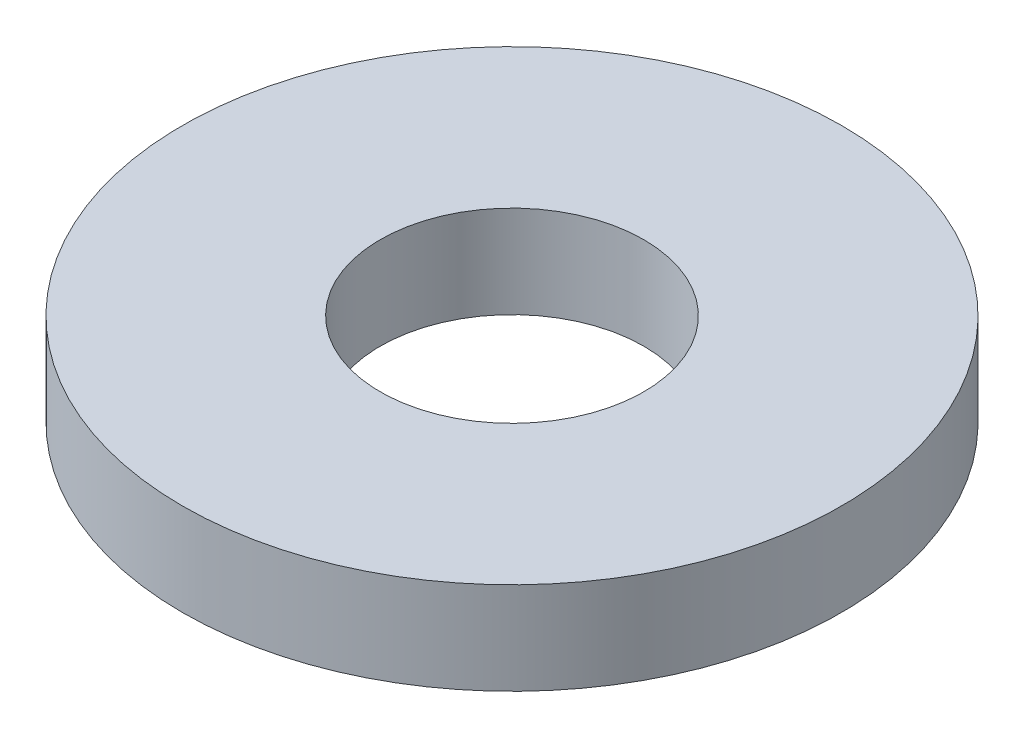
ISO-10303-21;
HEADER;
FILE_DESCRIPTION(('STEP AP214'),'2;1');
FILE_NAME('part.step','',(''),(''),'','','');
FILE_SCHEMA(('AUTOMOTIVE_DESIGN { 1 0 10303 214 1 1 1 1 }'));
ENDSEC;
DATA;
#1=APPLICATION_CONTEXT('core data for automotive mechanical design processes');
#2=APPLICATION_PROTOCOL_DEFINITION('international standard','automotive_design',2000,#1);
#3=PRODUCT_CONTEXT('',#1,'mechanical');
#4=PRODUCT('Part','Part','',(#3));
#5=PRODUCT_RELATED_PRODUCT_CATEGORY('part','',(#4));
#6=PRODUCT_DEFINITION_FORMATION('','',#4);
#7=PRODUCT_DEFINITION_CONTEXT('part definition',#1,'design');
#8=PRODUCT_DEFINITION('design','',#6,#7);
#9=PRODUCT_DEFINITION_SHAPE('','',#8);
#10=(LENGTH_UNIT() NAMED_UNIT(*) SI_UNIT(.MILLI.,.METRE.));
#11=(NAMED_UNIT(*) PLANE_ANGLE_UNIT() SI_UNIT($,.RADIAN.));
#12=(NAMED_UNIT(*) SI_UNIT($,.STERADIAN.) SOLID_ANGLE_UNIT());
#13=UNCERTAINTY_MEASURE_WITH_UNIT(LENGTH_MEASURE(1.E-05),#10,'distance_accuracy_value','');
#14=(GEOMETRIC_REPRESENTATION_CONTEXT(3) GLOBAL_UNCERTAINTY_ASSIGNED_CONTEXT((#13)) GLOBAL_UNIT_ASSIGNED_CONTEXT((#10,
#11,#12)) REPRESENTATION_CONTEXT('',''));
#15=CARTESIAN_POINT('',(0.,0.,0.));
#16=DIRECTION('',(0.,0.,1.));
#17=DIRECTION('',(1.,0.,0.));
#18=AXIS2_PLACEMENT_3D('',#15,#16,#17);
#19=CARTESIAN_POINT('',(0.,21.,0.));
#20=DIRECTION('',(0.,-1.,0.));
#21=DIRECTION('',(0.,0.,-1.));
#22=AXIS2_PLACEMENT_3D('',#19,#20,#21);
#23=CYLINDRICAL_SURFACE('',#22,75.);
#24=CARTESIAN_POINT('',(0.,21.,0.));
#25=DIRECTION('',(0.,1.,0.));
#26=DIRECTION('',(0.,0.,1.));
#27=AXIS2_PLACEMENT_3D('',#24,#25,#26);
#28=CIRCLE('',#27,75.);
#29=CARTESIAN_POINT('',(0.,21.,-75.));
#30=VERTEX_POINT('',#29);
#31=EDGE_CURVE('E10',#30,#30,#28,.T.);
#32=CARTESIAN_POINT('',(0.,0.,0.));
#33=DIRECTION('',(0.,1.,0.));
#34=DIRECTION('',(0.,0.,1.));
#35=AXIS2_PLACEMENT_3D('',#32,#33,#34);
#36=CIRCLE('',#35,75.);
#37=CARTESIAN_POINT('',(0.,0.,-75.));
#38=VERTEX_POINT('',#37);
#39=EDGE_CURVE('E37',#38,#38,#36,.T.);
#40=CARTESIAN_POINT('',(0.,21.,-75.));
#41=CARTESIAN_POINT('',(0.,20.78125,-75.));
#42=CARTESIAN_POINT('',(0.,20.5625,-75.));
#43=CARTESIAN_POINT('',(0.,20.125,-75.));
#44=CARTESIAN_POINT('',(0.,19.90625,-75.));
#45=CARTESIAN_POINT('',(0.,19.46875,-75.));
#46=CARTESIAN_POINT('',(0.,19.25,-75.));
#47=CARTESIAN_POINT('',(0.,18.8125,-75.));
#48=CARTESIAN_POINT('',(0.,18.59375,-75.));
#49=CARTESIAN_POINT('',(0.,18.15625,-75.));
#50=CARTESIAN_POINT('',(0.,17.9375,-75.));
#51=CARTESIAN_POINT('',(0.,17.5,-75.));
#52=CARTESIAN_POINT('',(0.,17.28125,-75.));
#53=CARTESIAN_POINT('',(0.,16.84375,-75.));
#54=CARTESIAN_POINT('',(0.,16.625,-75.));
#55=CARTESIAN_POINT('',(0.,16.1875,-75.));
#56=CARTESIAN_POINT('',(0.,15.96875,-75.));
#57=CARTESIAN_POINT('',(0.,15.53125,-75.));
#58=CARTESIAN_POINT('',(0.,15.3125,-75.));
#59=CARTESIAN_POINT('',(0.,14.875,-75.));
#60=CARTESIAN_POINT('',(0.,14.65625,-75.));
#61=CARTESIAN_POINT('',(0.,14.21875,-75.));
#62=CARTESIAN_POINT('',(0.,14.,-75.));
#63=CARTESIAN_POINT('',(0.,13.5625,-75.));
#64=CARTESIAN_POINT('',(0.,13.34375,-75.));
#65=CARTESIAN_POINT('',(0.,12.90625,-75.));
#66=CARTESIAN_POINT('',(0.,12.6875,-75.));
#67=CARTESIAN_POINT('',(0.,12.25,-75.));
#68=CARTESIAN_POINT('',(0.,12.03125,-75.));
#69=CARTESIAN_POINT('',(0.,11.59375,-75.));
#70=CARTESIAN_POINT('',(0.,11.375,-75.));
#71=CARTESIAN_POINT('',(0.,10.9375,-75.));
#72=CARTESIAN_POINT('',(0.,10.71875,-75.));
#73=CARTESIAN_POINT('',(0.,10.28125,-75.));
#74=CARTESIAN_POINT('',(0.,10.0625,-75.));
#75=CARTESIAN_POINT('',(0.,9.625,-75.));
#76=CARTESIAN_POINT('',(0.,9.40625,-75.));
#77=CARTESIAN_POINT('',(0.,8.96875,-75.));
#78=CARTESIAN_POINT('',(0.,8.75,-75.));
#79=CARTESIAN_POINT('',(0.,8.3125,-75.));
#80=CARTESIAN_POINT('',(0.,8.09375,-75.));
#81=CARTESIAN_POINT('',(0.,7.65625,-75.));
#82=CARTESIAN_POINT('',(0.,7.4375,-75.));
#83=CARTESIAN_POINT('',(0.,7.,-75.));
#84=CARTESIAN_POINT('',(0.,6.78125,-75.));
#85=CARTESIAN_POINT('',(0.,6.34375,-75.));
#86=CARTESIAN_POINT('',(0.,6.125,-75.));
#87=CARTESIAN_POINT('',(0.,5.6875,-75.));
#88=CARTESIAN_POINT('',(0.,5.46875,-75.));
#89=CARTESIAN_POINT('',(0.,5.03125,-75.));
#90=CARTESIAN_POINT('',(0.,4.8125,-75.));
#91=CARTESIAN_POINT('',(0.,4.375,-75.));
#92=CARTESIAN_POINT('',(0.,4.15625,-75.));
#93=CARTESIAN_POINT('',(0.,3.71875,-75.));
#94=CARTESIAN_POINT('',(0.,3.5,-75.));
#95=CARTESIAN_POINT('',(0.,3.0625,-75.));
#96=CARTESIAN_POINT('',(0.,2.84375,-75.));
#97=CARTESIAN_POINT('',(0.,2.40625,-75.));
#98=CARTESIAN_POINT('',(0.,2.1875,-75.));
#99=CARTESIAN_POINT('',(0.,1.75,-75.));
#100=CARTESIAN_POINT('',(0.,1.53125,-75.));
#101=CARTESIAN_POINT('',(0.,1.09375,-75.));
#102=CARTESIAN_POINT('',(0.,0.875000000000001,-75.));
#103=CARTESIAN_POINT('',(0.,0.4375,-75.));
#104=CARTESIAN_POINT('',(0.,0.21875,-75.));
#105=CARTESIAN_POINT('',(0.,0.,-75.));
#106=B_SPLINE_CURVE_WITH_KNOTS('',3,(#40,#41,#42,#43,#44,#45,#46,#47,#48,#49,#50,#51,#52,#53,
#54,#55,#56,#57,#58,#59,#60,#61,#62,#63,#64,#65,#66,#67,#68,#69,#70,#71,#72,#73,#74,#75,#76,#77,
#78,#79,#80,#81,#82,#83,#84,#85,#86,#87,#88,#89,#90,#91,#92,#93,#94,#95,#96,#97,#98,#99,#100,
#101,#102,#103,#104,#105),.UNSPECIFIED.,.F.,.F.,(4,2,2,2,2,2,2,2,2,2,2,2,2,2,2,2,2,2,2,2,2,2,2,
2,2,2,2,2,2,2,2,2,4),(0.,0.656250000000001,1.3125,1.96875,2.625,3.28125,3.9375,4.59375,5.25,
5.90625,6.5625,7.21875,7.875,8.53125,9.1875,9.84375,10.5,11.15625,11.8125,12.46875,13.125,
13.78125,14.4375,15.09375,15.75,16.40625,17.0625,17.71875,18.375,19.03125,19.6875,20.34375,21.),.UNSPECIFIED.);
#107=EDGE_CURVE('BSEAM40',#30,#38,#106,.T.);
#108=ORIENTED_EDGE('',*,*,#31,.F.);
#109=ORIENTED_EDGE('',*,*,#39,.T.);
#110=ORIENTED_EDGE('',*,*,#107,.T.);
#111=ORIENTED_EDGE('',*,*,#107,.F.);
#112=EDGE_LOOP('',(#108,#110,#109,#111));
#113=FACE_BOUND('',#112,.T.);
#114=ADVANCED_FACE('F40',(#113),#23,.T.);
#115=CARTESIAN_POINT('',(0.,21.,0.));
#116=DIRECTION('',(0.,1.,0.));
#117=DIRECTION('',(0.,0.,1.));
#118=AXIS2_PLACEMENT_3D('',#115,#116,#117);
#119=PLANE('',#118);
#120=CARTESIAN_POINT('',(0.,21.,0.));
#121=DIRECTION('',(0.,1.,0.));
#122=DIRECTION('',(0.,0.,1.));
#123=AXIS2_PLACEMENT_3D('',#120,#121,#122);
#124=CIRCLE('',#123,30.);
#125=CARTESIAN_POINT('',(0.,21.,-30.));
#126=VERTEX_POINT('',#125);
#127=EDGE_CURVE('E50',#126,#126,#124,.T.);
#128=ORIENTED_EDGE('',*,*,#127,.F.);
#129=EDGE_LOOP('',(#128));
#130=FACE_BOUND('',#129,.T.);
#131=ORIENTED_EDGE('',*,*,#31,.T.);
#132=EDGE_LOOP('',(#131));
#133=FACE_BOUND('',#132,.T.);
#134=ADVANCED_FACE('F59',(#130,#133),#119,.T.);
#135=CARTESIAN_POINT('',(0.,0.,0.));
#136=DIRECTION('',(0.,1.,0.));
#137=DIRECTION('',(0.,0.,1.));
#138=AXIS2_PLACEMENT_3D('',#135,#136,#137);
#139=PLANE('',#138);
#140=CARTESIAN_POINT('',(0.,0.,0.));
#141=DIRECTION('',(0.,1.,0.));
#142=DIRECTION('',(0.,0.,1.));
#143=AXIS2_PLACEMENT_3D('',#140,#141,#142);
#144=CIRCLE('',#143,30.);
#145=CARTESIAN_POINT('',(0.,0.,-30.));
#146=VERTEX_POINT('',#145);
#147=EDGE_CURVE('E47',#146,#146,#144,.T.);
#148=ORIENTED_EDGE('',*,*,#147,.T.);
#149=EDGE_LOOP('',(#148));
#150=FACE_BOUND('',#149,.T.);
#151=ORIENTED_EDGE('',*,*,#39,.F.);
#152=EDGE_LOOP('',(#151));
#153=FACE_BOUND('',#152,.T.);
#154=ADVANCED_FACE('F58',(#150,#153),#139,.F.);
#155=CARTESIAN_POINT('',(0.,21.,0.));
#156=DIRECTION('',(0.,-1.,0.));
#157=DIRECTION('',(0.,0.,-1.));
#158=AXIS2_PLACEMENT_3D('',#155,#156,#157);
#159=CYLINDRICAL_SURFACE('',#158,30.);
#160=CARTESIAN_POINT('',(0.,21.,-30.));
#161=CARTESIAN_POINT('',(0.,20.78125,-30.));
#162=CARTESIAN_POINT('',(0.,20.5625,-30.));
#163=CARTESIAN_POINT('',(0.,20.125,-30.));
#164=CARTESIAN_POINT('',(0.,19.90625,-30.));
#165=CARTESIAN_POINT('',(0.,19.46875,-30.));
#166=CARTESIAN_POINT('',(0.,19.25,-30.));
#167=CARTESIAN_POINT('',(0.,18.8125,-30.));
#168=CARTESIAN_POINT('',(0.,18.59375,-30.));
#169=CARTESIAN_POINT('',(0.,18.15625,-30.));
#170=CARTESIAN_POINT('',(0.,17.9375,-30.));
#171=CARTESIAN_POINT('',(0.,17.5,-30.));
#172=CARTESIAN_POINT('',(0.,17.28125,-30.));
#173=CARTESIAN_POINT('',(0.,16.84375,-30.));
#174=CARTESIAN_POINT('',(0.,16.625,-30.));
#175=CARTESIAN_POINT('',(0.,16.1875,-30.));
#176=CARTESIAN_POINT('',(0.,15.96875,-30.));
#177=CARTESIAN_POINT('',(0.,15.53125,-30.));
#178=CARTESIAN_POINT('',(0.,15.3125,-30.));
#179=CARTESIAN_POINT('',(0.,14.875,-30.));
#180=CARTESIAN_POINT('',(0.,14.65625,-30.));
#181=CARTESIAN_POINT('',(0.,14.21875,-30.));
#182=CARTESIAN_POINT('',(0.,14.,-30.));
#183=CARTESIAN_POINT('',(0.,13.5625,-30.));
#184=CARTESIAN_POINT('',(0.,13.34375,-30.));
#185=CARTESIAN_POINT('',(0.,12.90625,-30.));
#186=CARTESIAN_POINT('',(0.,12.6875,-30.));
#187=CARTESIAN_POINT('',(0.,12.25,-30.));
#188=CARTESIAN_POINT('',(0.,12.03125,-30.));
#189=CARTESIAN_POINT('',(0.,11.59375,-30.));
#190=CARTESIAN_POINT('',(0.,11.375,-30.));
#191=CARTESIAN_POINT('',(0.,10.9375,-30.));
#192=CARTESIAN_POINT('',(0.,10.71875,-30.));
#193=CARTESIAN_POINT('',(0.,10.28125,-30.));
#194=CARTESIAN_POINT('',(0.,10.0625,-30.));
#195=CARTESIAN_POINT('',(0.,9.625,-30.));
#196=CARTESIAN_POINT('',(0.,9.40625,-30.));
#197=CARTESIAN_POINT('',(0.,8.96875,-30.));
#198=CARTESIAN_POINT('',(0.,8.75,-30.));
#199=CARTESIAN_POINT('',(0.,8.3125,-30.));
#200=CARTESIAN_POINT('',(0.,8.09375,-30.));
#201=CARTESIAN_POINT('',(0.,7.65625,-30.));
#202=CARTESIAN_POINT('',(0.,7.4375,-30.));
#203=CARTESIAN_POINT('',(0.,7.,-30.));
#204=CARTESIAN_POINT('',(0.,6.78125,-30.));
#205=CARTESIAN_POINT('',(0.,6.34375,-30.));
#206=CARTESIAN_POINT('',(0.,6.125,-30.));
#207=CARTESIAN_POINT('',(0.,5.6875,-30.));
#208=CARTESIAN_POINT('',(0.,5.46875,-30.));
#209=CARTESIAN_POINT('',(0.,5.03125,-30.));
#210=CARTESIAN_POINT('',(0.,4.8125,-30.));
#211=CARTESIAN_POINT('',(0.,4.375,-30.));
#212=CARTESIAN_POINT('',(0.,4.15625,-30.));
#213=CARTESIAN_POINT('',(0.,3.71875,-30.));
#214=CARTESIAN_POINT('',(0.,3.5,-30.));
#215=CARTESIAN_POINT('',(0.,3.0625,-30.));
#216=CARTESIAN_POINT('',(0.,2.84375,-30.));
#217=CARTESIAN_POINT('',(0.,2.40625,-30.));
#218=CARTESIAN_POINT('',(0.,2.1875,-30.));
#219=CARTESIAN_POINT('',(0.,1.75,-30.));
#220=CARTESIAN_POINT('',(0.,1.53125,-30.));
#221=CARTESIAN_POINT('',(0.,1.09375,-30.));
#222=CARTESIAN_POINT('',(0.,0.875000000000001,-30.));
#223=CARTESIAN_POINT('',(0.,0.4375,-30.));
#224=CARTESIAN_POINT('',(0.,0.21875,-30.));
#225=CARTESIAN_POINT('',(0.,0.,-30.));
#226=B_SPLINE_CURVE_WITH_KNOTS('',3,(#160,#161,#162,#163,#164,#165,#166,#167,#168,#169,#170,
#171,#172,#173,#174,#175,#176,#177,#178,#179,#180,#181,#182,#183,#184,#185,#186,#187,#188,#189,
#190,#191,#192,#193,#194,#195,#196,#197,#198,#199,#200,#201,#202,#203,#204,#205,#206,#207,#208,
#209,#210,#211,#212,#213,#214,#215,#216,#217,#218,#219,#220,#221,#222,#223,#224,#225),
.UNSPECIFIED.,.F.,.F.,(4,2,2,2,2,2,2,2,2,2,2,2,2,2,2,2,2,2,2,2,2,2,2,2,2,2,2,2,2,2,2,2,4),(0.,
0.656249999999997,1.3125,1.96875,2.625,3.28125,3.9375,4.59375,5.25,5.90625,6.5625,7.21875,7.875,
8.53125,9.1875,9.84375,10.5,11.15625,11.8125,12.46875,13.125,13.78125,14.4375,15.09375,15.75,
16.40625,17.0625,17.71875,18.375,19.03125,19.6875,20.34375,21.),.UNSPECIFIED.);
#227=EDGE_CURVE('BSEAM54',#126,#146,#226,.T.);
#228=ORIENTED_EDGE('',*,*,#127,.T.);
#229=ORIENTED_EDGE('',*,*,#147,.F.);
#230=ORIENTED_EDGE('',*,*,#227,.T.);
#231=ORIENTED_EDGE('',*,*,#227,.F.);
#232=EDGE_LOOP('',(#228,#230,#229,#231));
#233=FACE_BOUND('',#232,.T.);
#234=ADVANCED_FACE('F54',(#233),#159,.F.);
#235=CLOSED_SHELL('',(#114,#134,#154,#234));
#236=MANIFOLD_SOLID_BREP('B2',#235);
#237=ADVANCED_BREP_SHAPE_REPRESENTATION('',(#18,#236),#14);
#238=SHAPE_DEFINITION_REPRESENTATION(#9,#237);
ENDSEC;
END-ISO-10303-21;
